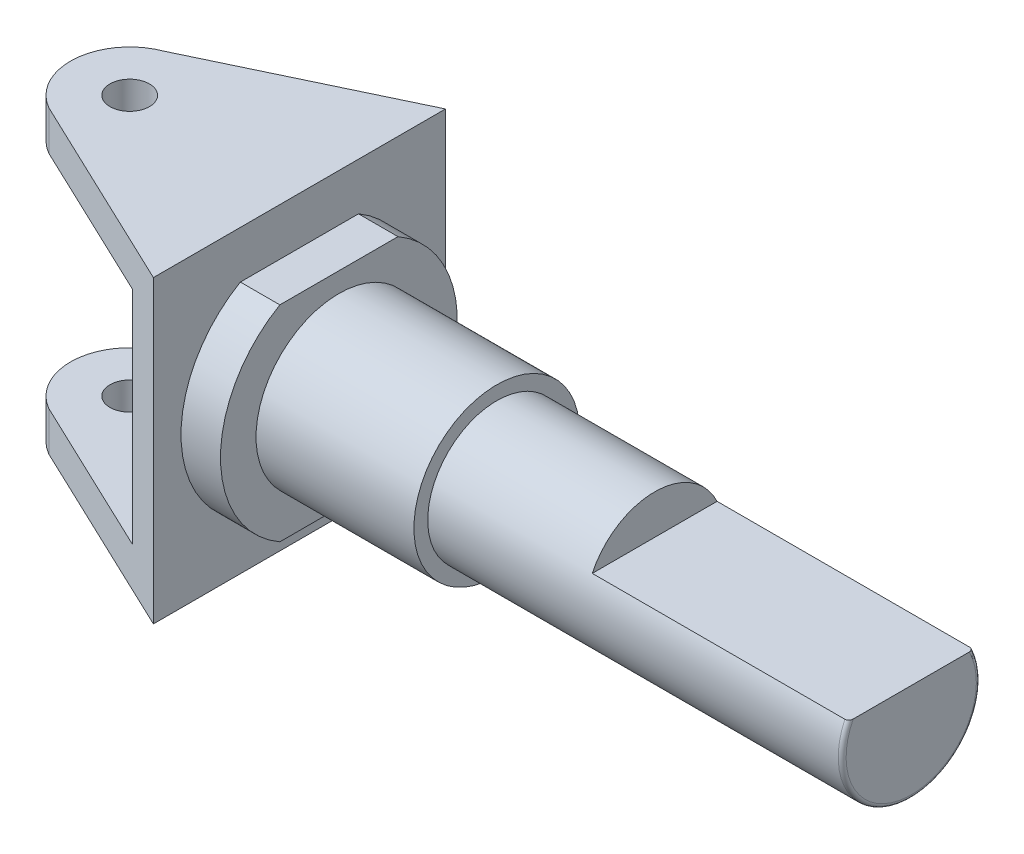
ISO-10303-21;
HEADER;
FILE_DESCRIPTION(('STEP AP214'),'2;1');
FILE_NAME('part.step','',(''),(''),'','','');
FILE_SCHEMA(('AUTOMOTIVE_DESIGN { 1 0 10303 214 1 1 1 1 }'));
ENDSEC;
DATA;
#1=APPLICATION_CONTEXT('core data for automotive mechanical design processes');
#2=APPLICATION_PROTOCOL_DEFINITION('international standard','automotive_design',2000,#1);
#3=PRODUCT_CONTEXT('',#1,'mechanical');
#4=PRODUCT('Part','Part','',(#3));
#5=PRODUCT_RELATED_PRODUCT_CATEGORY('part','',(#4));
#6=PRODUCT_DEFINITION_FORMATION('','',#4);
#7=PRODUCT_DEFINITION_CONTEXT('part definition',#1,'design');
#8=PRODUCT_DEFINITION('design','',#6,#7);
#9=PRODUCT_DEFINITION_SHAPE('','',#8);
#10=(LENGTH_UNIT() NAMED_UNIT(*) SI_UNIT(.MILLI.,.METRE.));
#11=(NAMED_UNIT(*) PLANE_ANGLE_UNIT() SI_UNIT($,.RADIAN.));
#12=(NAMED_UNIT(*) SI_UNIT($,.STERADIAN.) SOLID_ANGLE_UNIT());
#13=UNCERTAINTY_MEASURE_WITH_UNIT(LENGTH_MEASURE(1.E-05),#10,'distance_accuracy_value','');
#14=(GEOMETRIC_REPRESENTATION_CONTEXT(3) GLOBAL_UNCERTAINTY_ASSIGNED_CONTEXT((#13)) GLOBAL_UNIT_ASSIGNED_CONTEXT((#10,
#11,#12)) REPRESENTATION_CONTEXT('',''));
#15=CARTESIAN_POINT('',(0.,0.,0.));
#16=DIRECTION('',(0.,0.,1.));
#17=DIRECTION('',(1.,0.,0.));
#18=AXIS2_PLACEMENT_3D('',#15,#16,#17);
#19=CARTESIAN_POINT('',(-8.94992448054611,-7.89605816136122,37.));
#20=DIRECTION('',(1.,0.,0.));
#21=DIRECTION('',(0.,0.,-1.));
#22=AXIS2_PLACEMENT_3D('',#19,#20,#21);
#23=CYLINDRICAL_SURFACE('',#22,30.);
#24=CARTESIAN_POINT('',(6.05007551945388,-7.89605816136122,37.));
#25=DIRECTION('',(1.,0.,0.));
#26=DIRECTION('',(0.,1.,0.));
#27=AXIS2_PLACEMENT_3D('',#24,#25,#26);
#28=CIRCLE('',#27,30.);
#29=CARTESIAN_POINT('',(6.05007551945388,18.1039418386388,51.9666295470958));
#30=VERTEX_POINT('',#29);
#31=CARTESIAN_POINT('',(6.05007551945389,-33.8960581613612,51.9666295470957));
#32=VERTEX_POINT('',#31);
#33=EDGE_CURVE('E164',#30,#32,#28,.T.);
#34=ORIENTED_EDGE('',*,*,#33,.F.);
#35=DIRECTION('',(1.,0.,0.));
#36=VECTOR('',#35,1.);
#37=CARTESIAN_POINT('',(-3.94992448054611,18.1039418386388,51.9666295470958));
#38=LINE('',#37,#36);
#39=CARTESIAN_POINT('',(-3.94992448054611,18.1039418386388,51.9666295470958));
#40=VERTEX_POINT('',#39);
#41=EDGE_CURVE('E67',#40,#30,#38,.T.);
#42=ORIENTED_EDGE('',*,*,#41,.F.);
#43=CARTESIAN_POINT('',(-3.94992448054611,-7.89605816136122,37.));
#44=DIRECTION('',(-1.,0.,0.));
#45=DIRECTION('',(0.,-1.,0.));
#46=AXIS2_PLACEMENT_3D('',#43,#44,#45);
#47=CIRCLE('',#46,30.);
#48=CARTESIAN_POINT('',(-3.94992448054611,-33.8960581613612,51.9666295470957));
#49=VERTEX_POINT('',#48);
#50=EDGE_CURVE('E162',#49,#40,#47,.T.);
#51=ORIENTED_EDGE('',*,*,#50,.F.);
#52=DIRECTION('',(1.,0.,0.));
#53=VECTOR('',#52,1.);
#54=CARTESIAN_POINT('',(-3.94992448054611,-33.8960581613612,51.9666295470957));
#55=LINE('',#54,#53);
#56=EDGE_CURVE('E520',#49,#32,#55,.T.);
#57=ORIENTED_EDGE('',*,*,#56,.T.);
#58=EDGE_LOOP('',(#34,#42,#51,#57));
#59=FACE_BOUND('',#58,.T.);
#60=ADVANCED_FACE('F39',(#59),#23,.T.);
#61=CARTESIAN_POINT('',(-3.94992448054611,18.1039418386388,22.0333704529042));
#62=VERTEX_POINT('',#61);
#63=CARTESIAN_POINT('',(-3.94992448054611,-33.8960581613612,22.0333704529042));
#64=VERTEX_POINT('',#63);
#65=EDGE_CURVE('E171',#62,#64,#47,.T.);
#66=ORIENTED_EDGE('',*,*,#65,.F.);
#67=DIRECTION('',(1.,0.,0.));
#68=VECTOR('',#67,1.);
#69=CARTESIAN_POINT('',(-3.94992448054611,18.1039418386388,22.0333704529042));
#70=LINE('',#69,#68);
#71=CARTESIAN_POINT('',(6.05007551945389,18.1039418386388,22.0333704529042));
#72=VERTEX_POINT('',#71);
#73=EDGE_CURVE('E151',#62,#72,#70,.T.);
#74=ORIENTED_EDGE('',*,*,#73,.T.);
#75=CARTESIAN_POINT('',(6.05007551945389,-33.8960581613612,22.0333704529042));
#76=VERTEX_POINT('',#75);
#77=EDGE_CURVE('E519',#76,#72,#28,.T.);
#78=ORIENTED_EDGE('',*,*,#77,.F.);
#79=DIRECTION('',(1.,0.,0.));
#80=VECTOR('',#79,1.);
#81=CARTESIAN_POINT('',(-3.94992448054611,-33.8960581613612,22.0333704529042));
#82=LINE('',#81,#80);
#83=EDGE_CURVE('E59',#64,#76,#82,.T.);
#84=ORIENTED_EDGE('',*,*,#83,.F.);
#85=EDGE_LOOP('',(#66,#74,#78,#84));
#86=FACE_BOUND('',#85,.T.);
#87=ADVANCED_FACE('F222',(#86),#23,.T.);
#88=CARTESIAN_POINT('',(6.05007551945389,0.,0.));
#89=DIRECTION('',(1.,0.,0.));
#90=DIRECTION('',(0.,0.,-1.));
#91=AXIS2_PLACEMENT_3D('',#88,#89,#90);
#92=PLANE('',#91);
#93=CARTESIAN_POINT('',(6.05007551945389,-7.89605816136122,37.));
#94=DIRECTION('',(1.,0.,0.));
#95=DIRECTION('',(0.,0.,-1.));
#96=AXIS2_PLACEMENT_3D('',#93,#94,#95);
#97=CIRCLE('',#96,21.);
#98=CARTESIAN_POINT('',(6.05007551945389,-7.89605816136122,16.));
#99=VERTEX_POINT('',#98);
#100=EDGE_CURVE('E179',#99,#99,#97,.T.);
#101=ORIENTED_EDGE('',*,*,#100,.F.);
#102=EDGE_LOOP('',(#101));
#103=FACE_BOUND('',#102,.T.);
#104=ORIENTED_EDGE('',*,*,#77,.T.);
#105=DIRECTION('',(0.,0.,1.));
#106=VECTOR('',#105,1.);
#107=CARTESIAN_POINT('',(6.05007551945389,18.1039418386388,22.0333704529042));
#108=LINE('',#107,#106);
#109=EDGE_CURVE('E156',#72,#30,#108,.T.);
#110=ORIENTED_EDGE('',*,*,#109,.T.);
#111=ORIENTED_EDGE('',*,*,#33,.T.);
#112=DIRECTION('',(0.,0.,-1.));
#113=VECTOR('',#112,1.);
#114=CARTESIAN_POINT('',(6.05007551945389,-33.8960581613612,51.9666295470957));
#115=LINE('',#114,#113);
#116=EDGE_CURVE('E522',#32,#76,#115,.T.);
#117=ORIENTED_EDGE('',*,*,#116,.T.);
#118=EDGE_LOOP('',(#104,#110,#111,#117));
#119=FACE_BOUND('',#118,.T.);
#120=ADVANCED_FACE('F223',(#103,#119),#92,.T.);
#121=CARTESIAN_POINT('',(-61.9499244805461,30.1039418386388,74.));
#122=DIRECTION('',(0.,-1.,0.));
#123=DIRECTION('',(0.,0.,-1.));
#124=AXIS2_PLACEMENT_3D('',#121,#122,#123);
#125=PLANE('',#124);
#126=CARTESIAN_POINT('',(-46.9499244805461,30.1039418386388,37.));
#127=DIRECTION('',(0.,1.,0.));
#128=DIRECTION('',(0.,0.,1.));
#129=AXIS2_PLACEMENT_3D('',#126,#127,#128);
#130=CIRCLE('',#129,5.);
#131=CARTESIAN_POINT('',(-46.9499244805461,30.1039418386388,42.));
#132=VERTEX_POINT('',#131);
#133=EDGE_CURVE('E170',#132,#132,#130,.T.);
#134=ORIENTED_EDGE('',*,*,#133,.F.);
#135=EDGE_LOOP('',(#134));
#136=FACE_BOUND('',#135,.T.);
#137=CARTESIAN_POINT('',(-46.9499244805461,30.1039418386388,37.));
#138=DIRECTION('',(0.,1.,0.));
#139=DIRECTION('',(0.,0.,1.));
#140=AXIS2_PLACEMENT_3D('',#137,#138,#139);
#141=CIRCLE('',#140,15.);
#142=CARTESIAN_POINT('',(-52.267361900777,30.1039418386388,22.9741360593392));
#143=VERTEX_POINT('',#142);
#144=CARTESIAN_POINT('',(-54.4721482602545,30.1039418386388,49.9775247797101));
#145=VERTEX_POINT('',#144);
#146=EDGE_CURVE('E271',#143,#145,#141,.T.);
#147=ORIENTED_EDGE('',*,*,#146,.T.);
#148=DIRECTION('',(-0.903108265488569,0.,-0.429412925755885));
#149=VECTOR('',#148,1.);
#150=CARTESIAN_POINT('',(-29.426018974015,30.1039418386388,61.8865417455175));
#151=LINE('',#150,#149);
#152=CARTESIAN_POINT('',(-3.94992448054612,30.1039418386388,74.));
#153=VERTEX_POINT('',#152);
#154=EDGE_CURVE('E275',#153,#145,#151,.T.);
#155=ORIENTED_EDGE('',*,*,#154,.F.);
#156=DIRECTION('',(0.,0.,-1.));
#157=VECTOR('',#156,1.);
#158=CARTESIAN_POINT('',(-3.94992448054612,30.1039418386388,74.));
#159=LINE('',#158,#157);
#160=CARTESIAN_POINT('',(-3.94992448054612,30.1039418386388,0.));
#161=VERTEX_POINT('',#160);
#162=EDGE_CURVE('E326',#153,#161,#159,.T.);
#163=ORIENTED_EDGE('',*,*,#162,.T.);
#164=DIRECTION('',(-0.903108265488569,0.,0.429412925755885));
#165=VECTOR('',#164,1.);
#166=CARTESIAN_POINT('',(-0.728348144740107,30.1039418386388,-1.53180584517847));
#167=LINE('',#166,#165);
#168=EDGE_CURVE('E277',#161,#143,#167,.T.);
#169=ORIENTED_EDGE('',*,*,#168,.T.);
#170=EDGE_LOOP('',(#147,#155,#163,#169));
#171=FACE_BOUND('',#170,.T.);
#172=ADVANCED_FACE('F226',(#136,#171),#125,.F.);
#173=CARTESIAN_POINT('',(-61.9499244805461,20.1039418386388,74.));
#174=DIRECTION('',(0.,1.,0.));
#175=DIRECTION('',(0.,0.,1.));
#176=AXIS2_PLACEMENT_3D('',#173,#174,#175);
#177=PLANE('',#176);
#178=CARTESIAN_POINT('',(-46.9499244805461,20.1039418386388,37.));
#179=DIRECTION('',(0.,1.,0.));
#180=DIRECTION('',(0.,0.,1.));
#181=AXIS2_PLACEMENT_3D('',#178,#179,#180);
#182=CIRCLE('',#181,5.);
#183=CARTESIAN_POINT('',(-46.9499244805461,20.1039418386388,42.));
#184=VERTEX_POINT('',#183);
#185=EDGE_CURVE('E290',#184,#184,#182,.T.);
#186=ORIENTED_EDGE('',*,*,#185,.T.);
#187=EDGE_LOOP('',(#186));
#188=FACE_BOUND('',#187,.T.);
#189=DIRECTION('',(-0.903108265488569,0.,-0.429412925755885));
#190=VECTOR('',#189,1.);
#191=CARTESIAN_POINT('',(-51.2549877537848,20.1039418386388,51.5072309716494));
#192=LINE('',#191,#190);
#193=CARTESIAN_POINT('',(-13.9499244805461,20.1039418386388,69.2451666963365));
#194=VERTEX_POINT('',#193);
#195=CARTESIAN_POINT('',(-54.4721482602545,20.1039418386388,49.9775247797101));
#196=VERTEX_POINT('',#195);
#197=EDGE_CURVE('E279',#194,#196,#192,.T.);
#198=ORIENTED_EDGE('',*,*,#197,.T.);
#199=CARTESIAN_POINT('',(-46.9499244805461,20.1039418386388,37.));
#200=DIRECTION('',(0.,1.,0.));
#201=DIRECTION('',(0.,0.,1.));
#202=AXIS2_PLACEMENT_3D('',#199,#200,#201);
#203=CIRCLE('',#202,15.);
#204=CARTESIAN_POINT('',(-52.267361900777,20.1039418386388,22.9741360593392));
#205=VERTEX_POINT('',#204);
#206=EDGE_CURVE('E284',#205,#196,#203,.T.);
#207=ORIENTED_EDGE('',*,*,#206,.F.);
#208=DIRECTION('',(-0.903108265488569,0.,0.429412925755885));
#209=VECTOR('',#208,1.);
#210=CARTESIAN_POINT('',(-79.9526585830597,20.1039418386388,36.1380331280115));
#211=LINE('',#210,#209);
#212=CARTESIAN_POINT('',(-13.9499244805461,20.1039418386388,4.75483330366351));
#213=VERTEX_POINT('',#212);
#214=EDGE_CURVE('E319',#213,#205,#211,.T.);
#215=ORIENTED_EDGE('',*,*,#214,.F.);
#216=DIRECTION('',(0.,0.,-1.));
#217=VECTOR('',#216,1.);
#218=CARTESIAN_POINT('',(-13.9499244805461,20.1039418386388,74.));
#219=LINE('',#218,#217);
#220=EDGE_CURVE('E335',#194,#213,#219,.T.);
#221=ORIENTED_EDGE('',*,*,#220,.F.);
#222=EDGE_LOOP('',(#198,#207,#215,#221));
#223=FACE_BOUND('',#222,.T.);
#224=ADVANCED_FACE('F255',(#188,#223),#177,.F.);
#225=CARTESIAN_POINT('',(-61.9499244805461,-35.8960581613612,74.));
#226=DIRECTION('',(0.,-1.,0.));
#227=DIRECTION('',(0.,0.,-1.));
#228=AXIS2_PLACEMENT_3D('',#225,#226,#227);
#229=PLANE('',#228);
#230=CARTESIAN_POINT('',(-46.9499244805461,-35.8960581613612,37.));
#231=DIRECTION('',(0.,-1.,0.));
#232=DIRECTION('',(0.,0.,-1.));
#233=AXIS2_PLACEMENT_3D('',#230,#231,#232);
#234=CIRCLE('',#233,5.);
#235=CARTESIAN_POINT('',(-46.9499244805461,-35.8960581613612,32.));
#236=VERTEX_POINT('',#235);
#237=EDGE_CURVE('E293',#236,#236,#234,.T.);
#238=ORIENTED_EDGE('',*,*,#237,.T.);
#239=EDGE_LOOP('',(#238));
#240=FACE_BOUND('',#239,.T.);
#241=CARTESIAN_POINT('',(-46.9499244805461,-35.8960581613612,37.));
#242=DIRECTION('',(0.,-1.,0.));
#243=DIRECTION('',(0.,0.,-1.));
#244=AXIS2_PLACEMENT_3D('',#241,#242,#243);
#245=CIRCLE('',#244,15.);
#246=CARTESIAN_POINT('',(-54.4721482602545,-35.8960581613612,49.9775247797101));
#247=VERTEX_POINT('',#246);
#248=CARTESIAN_POINT('',(-52.267361900777,-35.8960581613612,22.9741360593392));
#249=VERTEX_POINT('',#248);
#250=EDGE_CURVE('E321',#247,#249,#245,.T.);
#251=ORIENTED_EDGE('',*,*,#250,.F.);
#252=DIRECTION('',(0.903108265488569,0.,0.429412925755885));
#253=VECTOR('',#252,1.);
#254=CARTESIAN_POINT('',(-51.2549877537848,-35.8960581613612,51.5072309716494));
#255=LINE('',#254,#253);
#256=CARTESIAN_POINT('',(-13.9499244805461,-35.8960581613612,69.2451666963365));
#257=VERTEX_POINT('',#256);
#258=EDGE_CURVE('E300',#247,#257,#255,.T.);
#259=ORIENTED_EDGE('',*,*,#258,.T.);
#260=DIRECTION('',(0.,0.,-1.));
#261=VECTOR('',#260,1.);
#262=CARTESIAN_POINT('',(-13.9499244805461,-35.8960581613612,74.));
#263=LINE('',#262,#261);
#264=CARTESIAN_POINT('',(-13.9499244805461,-35.8960581613612,4.75483330366351));
#265=VERTEX_POINT('',#264);
#266=EDGE_CURVE('E333',#257,#265,#263,.T.);
#267=ORIENTED_EDGE('',*,*,#266,.T.);
#268=DIRECTION('',(0.903108265488569,0.,-0.429412925755885));
#269=VECTOR('',#268,1.);
#270=CARTESIAN_POINT('',(-79.9526585830597,-35.8960581613612,36.1380331280115));
#271=LINE('',#270,#269);
#272=EDGE_CURVE('E313',#249,#265,#271,.T.);
#273=ORIENTED_EDGE('',*,*,#272,.F.);
#274=EDGE_LOOP('',(#251,#259,#267,#273));
#275=FACE_BOUND('',#274,.T.);
#276=ADVANCED_FACE('F251',(#240,#275),#229,.F.);
#277=CARTESIAN_POINT('',(-3.94992448054611,-45.8960581613612,74.));
#278=DIRECTION('',(0.,1.,0.));
#279=DIRECTION('',(-1.,0.,0.));
#280=AXIS2_PLACEMENT_3D('',#277,#278,#279);
#281=PLANE('',#280);
#282=CARTESIAN_POINT('',(-46.9499244805461,-45.8960581613612,37.));
#283=DIRECTION('',(0.,1.,0.));
#284=DIRECTION('',(-1.,0.,0.));
#285=AXIS2_PLACEMENT_3D('',#282,#283,#284);
#286=CIRCLE('',#285,5.);
#287=CARTESIAN_POINT('',(-51.9499244805461,-45.8960581613612,37.));
#288=VERTEX_POINT('',#287);
#289=EDGE_CURVE('E174',#288,#288,#286,.T.);
#290=ORIENTED_EDGE('',*,*,#289,.T.);
#291=EDGE_LOOP('',(#290));
#292=FACE_BOUND('',#291,.T.);
#293=DIRECTION('',(-0.903108265488569,0.,-0.429412925755885));
#294=VECTOR('',#293,1.);
#295=CARTESIAN_POINT('',(-3.94992448054611,-45.8960581613612,74.));
#296=LINE('',#295,#294);
#297=CARTESIAN_POINT('',(-3.94992448054612,-45.8960581613612,74.));
#298=VERTEX_POINT('',#297);
#299=CARTESIAN_POINT('',(-54.4721482602545,-45.8960581613612,49.9775247797101));
#300=VERTEX_POINT('',#299);
#301=EDGE_CURVE('E297',#298,#300,#296,.T.);
#302=ORIENTED_EDGE('',*,*,#301,.T.);
#303=CARTESIAN_POINT('',(-46.9499244805461,-45.8960581613612,37.));
#304=DIRECTION('',(0.,1.,0.));
#305=DIRECTION('',(-1.,0.,0.));
#306=AXIS2_PLACEMENT_3D('',#303,#304,#305);
#307=CIRCLE('',#306,15.);
#308=CARTESIAN_POINT('',(-52.267361900777,-45.8960581613612,22.9741360593392));
#309=VERTEX_POINT('',#308);
#310=EDGE_CURVE('E183',#309,#300,#307,.T.);
#311=ORIENTED_EDGE('',*,*,#310,.F.);
#312=DIRECTION('',(-0.903108265488569,0.,0.429412925755885));
#313=VECTOR('',#312,1.);
#314=CARTESIAN_POINT('',(-32.647595309821,-45.8960581613612,13.645264099661));
#315=LINE('',#314,#313);
#316=CARTESIAN_POINT('',(-3.94992448054612,-45.8960581613612,0.));
#317=VERTEX_POINT('',#316);
#318=EDGE_CURVE('E311',#317,#309,#315,.T.);
#319=ORIENTED_EDGE('',*,*,#318,.F.);
#320=DIRECTION('',(0.,0.,-1.));
#321=VECTOR('',#320,1.);
#322=CARTESIAN_POINT('',(-3.94992448054611,-45.8960581613612,74.));
#323=LINE('',#322,#321);
#324=EDGE_CURVE('E330',#298,#317,#323,.T.);
#325=ORIENTED_EDGE('',*,*,#324,.F.);
#326=EDGE_LOOP('',(#302,#311,#319,#325));
#327=FACE_BOUND('',#326,.T.);
#328=ADVANCED_FACE('F248',(#292,#327),#281,.F.);
#329=CARTESIAN_POINT('',(-13.9499244805461,-35.8960581613612,74.));
#330=DIRECTION('',(1.,0.,0.));
#331=DIRECTION('',(0.,0.,-1.));
#332=AXIS2_PLACEMENT_3D('',#329,#330,#331);
#333=PLANE('',#332);
#334=ORIENTED_EDGE('',*,*,#266,.F.);
#335=DIRECTION('',(0.,1.,0.));
#336=VECTOR('',#335,1.);
#337=CARTESIAN_POINT('',(-13.9499244805461,-35.8960581613612,69.2451666963365));
#338=LINE('',#337,#336);
#339=EDGE_CURVE('E303',#257,#194,#338,.T.);
#340=ORIENTED_EDGE('',*,*,#339,.T.);
#341=ORIENTED_EDGE('',*,*,#220,.T.);
#342=DIRECTION('',(0.,1.,0.));
#343=VECTOR('',#342,1.);
#344=CARTESIAN_POINT('',(-13.9499244805461,-35.8960581613612,4.75483330366351));
#345=LINE('',#344,#343);
#346=EDGE_CURVE('E316',#265,#213,#345,.T.);
#347=ORIENTED_EDGE('',*,*,#346,.F.);
#348=EDGE_LOOP('',(#334,#340,#341,#347));
#349=FACE_BOUND('',#348,.T.);
#350=ADVANCED_FACE('F247',(#349),#333,.F.);
#351=CARTESIAN_POINT('',(-3.94992448054612,30.1039418386388,74.));
#352=DIRECTION('',(-1.,0.,0.));
#353=DIRECTION('',(0.,-1.,0.));
#354=AXIS2_PLACEMENT_3D('',#351,#352,#353);
#355=PLANE('',#354);
#356=ORIENTED_EDGE('',*,*,#50,.T.);
#357=DIRECTION('',(0.,0.,1.));
#358=VECTOR('',#357,1.);
#359=CARTESIAN_POINT('',(-3.94992448054611,18.1039418386388,22.0333704529042));
#360=LINE('',#359,#358);
#361=EDGE_CURVE('E148',#62,#40,#360,.T.);
#362=ORIENTED_EDGE('',*,*,#361,.F.);
#363=ORIENTED_EDGE('',*,*,#65,.T.);
#364=DIRECTION('',(0.,0.,-1.));
#365=VECTOR('',#364,1.);
#366=CARTESIAN_POINT('',(-3.94992448054611,-33.8960581613612,51.9666295470957));
#367=LINE('',#366,#365);
#368=EDGE_CURVE('E169',#49,#64,#367,.T.);
#369=ORIENTED_EDGE('',*,*,#368,.F.);
#370=EDGE_LOOP('',(#356,#362,#363,#369));
#371=FACE_BOUND('',#370,.T.);
#372=DIRECTION('',(0.,1.,0.));
#373=VECTOR('',#372,1.);
#374=CARTESIAN_POINT('',(-3.94992448054612,30.1039418386388,0.));
#375=LINE('',#374,#373);
#376=EDGE_CURVE('E324',#317,#161,#375,.T.);
#377=ORIENTED_EDGE('',*,*,#376,.T.);
#378=ORIENTED_EDGE('',*,*,#162,.F.);
#379=DIRECTION('',(0.,1.,0.));
#380=VECTOR('',#379,1.);
#381=CARTESIAN_POINT('',(-3.94992448054612,30.1039418386388,74.));
#382=LINE('',#381,#380);
#383=EDGE_CURVE('E289',#298,#153,#382,.T.);
#384=ORIENTED_EDGE('',*,*,#383,.F.);
#385=ORIENTED_EDGE('',*,*,#324,.T.);
#386=EDGE_LOOP('',(#377,#378,#384,#385));
#387=FACE_BOUND('',#386,.T.);
#388=ADVANCED_FACE('F167',(#371,#387),#355,.F.);
#389=CARTESIAN_POINT('',(-46.9499244805461,-69.8960581613612,37.));
#390=DIRECTION('',(0.,1.,0.));
#391=DIRECTION('',(0.,0.,1.));
#392=AXIS2_PLACEMENT_3D('',#389,#390,#391);
#393=CYLINDRICAL_SURFACE('',#392,15.);
#394=ORIENTED_EDGE('',*,*,#206,.T.);
#395=DIRECTION('',(0.,1.,0.));
#396=VECTOR('',#395,1.);
#397=CARTESIAN_POINT('',(-54.4721482602545,-69.8960581613612,49.9775247797101));
#398=LINE('',#397,#396);
#399=EDGE_CURVE('E282',#196,#145,#398,.T.);
#400=ORIENTED_EDGE('',*,*,#399,.T.);
#401=ORIENTED_EDGE('',*,*,#146,.F.);
#402=DIRECTION('',(0.,1.,0.));
#403=VECTOR('',#402,1.);
#404=CARTESIAN_POINT('',(-52.267361900777,-69.8960581613612,22.9741360593392));
#405=LINE('',#404,#403);
#406=EDGE_CURVE('E308',#205,#143,#405,.T.);
#407=ORIENTED_EDGE('',*,*,#406,.F.);
#408=EDGE_LOOP('',(#394,#400,#401,#407));
#409=FACE_BOUND('',#408,.T.);
#410=ADVANCED_FACE('F241',(#409),#393,.T.);
#411=ORIENTED_EDGE('',*,*,#250,.T.);
#412=EDGE_CURVE('E310',#309,#249,#405,.T.);
#413=ORIENTED_EDGE('',*,*,#412,.F.);
#414=ORIENTED_EDGE('',*,*,#310,.T.);
#415=EDGE_CURVE('E286',#300,#247,#398,.T.);
#416=ORIENTED_EDGE('',*,*,#415,.T.);
#417=EDGE_LOOP('',(#411,#413,#414,#416));
#418=FACE_BOUND('',#417,.T.);
#419=ADVANCED_FACE('F239',(#418),#393,.T.);
#420=CARTESIAN_POINT('',(-0.728348144740107,-69.8960581613612,-1.53180584517847));
#421=DIRECTION('',(-0.429412925755885,0.,-0.903108265488569));
#422=DIRECTION('',(-0.903108265488569,0.,0.429412925755885));
#423=AXIS2_PLACEMENT_3D('',#420,#421,#422);
#424=PLANE('',#423);
#425=ORIENTED_EDGE('',*,*,#214,.T.);
#426=ORIENTED_EDGE('',*,*,#406,.T.);
#427=ORIENTED_EDGE('',*,*,#168,.F.);
#428=ORIENTED_EDGE('',*,*,#376,.F.);
#429=ORIENTED_EDGE('',*,*,#318,.T.);
#430=ORIENTED_EDGE('',*,*,#412,.T.);
#431=ORIENTED_EDGE('',*,*,#272,.T.);
#432=ORIENTED_EDGE('',*,*,#346,.T.);
#433=EDGE_LOOP('',(#425,#426,#427,#428,#429,#430,#431,#432));
#434=FACE_BOUND('',#433,.T.);
#435=ADVANCED_FACE('F235',(#434),#424,.T.);
#436=CARTESIAN_POINT('',(-29.426018974015,-69.8960581613612,61.8865417455175));
#437=DIRECTION('',(0.429412925755885,0.,-0.903108265488569));
#438=DIRECTION('',(-0.903108265488569,0.,-0.429412925755885));
#439=AXIS2_PLACEMENT_3D('',#436,#437,#438);
#440=PLANE('',#439);
#441=ORIENTED_EDGE('',*,*,#339,.F.);
#442=ORIENTED_EDGE('',*,*,#258,.F.);
#443=ORIENTED_EDGE('',*,*,#415,.F.);
#444=ORIENTED_EDGE('',*,*,#301,.F.);
#445=ORIENTED_EDGE('',*,*,#383,.T.);
#446=ORIENTED_EDGE('',*,*,#154,.T.);
#447=ORIENTED_EDGE('',*,*,#399,.F.);
#448=ORIENTED_EDGE('',*,*,#197,.F.);
#449=EDGE_LOOP('',(#441,#442,#443,#444,#445,#446,#447,#448));
#450=FACE_BOUND('',#449,.T.);
#451=ADVANCED_FACE('F232',(#450),#440,.F.);
#452=CARTESIAN_POINT('',(-46.9499244805461,-69.8960581613612,37.));
#453=DIRECTION('',(0.,1.,0.));
#454=DIRECTION('',(0.,0.,1.));
#455=AXIS2_PLACEMENT_3D('',#452,#453,#454);
#456=CYLINDRICAL_SURFACE('',#455,5.);
#457=ORIENTED_EDGE('',*,*,#289,.F.);
#458=EDGE_LOOP('',(#457));
#459=FACE_BOUND('',#458,.T.);
#460=ORIENTED_EDGE('',*,*,#237,.F.);
#461=EDGE_LOOP('',(#460));
#462=FACE_BOUND('',#461,.T.);
#463=ADVANCED_FACE('F230',(#459,#462),#456,.F.);
#464=ORIENTED_EDGE('',*,*,#133,.T.);
#465=EDGE_LOOP('',(#464));
#466=FACE_BOUND('',#465,.T.);
#467=ORIENTED_EDGE('',*,*,#185,.F.);
#468=EDGE_LOOP('',(#467));
#469=FACE_BOUND('',#468,.T.);
#470=ADVANCED_FACE('F216',(#466,#469),#456,.F.);
#471=CARTESIAN_POINT('',(46.0500755194539,0.,0.));
#472=DIRECTION('',(1.,0.,0.));
#473=DIRECTION('',(0.,0.,-1.));
#474=AXIS2_PLACEMENT_3D('',#471,#472,#473);
#475=PLANE('',#474);
#476=CARTESIAN_POINT('',(46.0500755194539,-7.89605816136123,37.));
#477=DIRECTION('',(1.,0.,0.));
#478=DIRECTION('',(0.,0.,-1.));
#479=AXIS2_PLACEMENT_3D('',#476,#477,#478);
#480=CIRCLE('',#479,17.5);
#481=CARTESIAN_POINT('',(46.0500755194539,-7.89605816136123,19.5));
#482=VERTEX_POINT('',#481);
#483=EDGE_CURVE('E182',#482,#482,#480,.T.);
#484=ORIENTED_EDGE('',*,*,#483,.F.);
#485=EDGE_LOOP('',(#484));
#486=FACE_BOUND('',#485,.T.);
#487=CARTESIAN_POINT('',(46.0500755194539,-7.89605816136122,37.));
#488=DIRECTION('',(1.,0.,0.));
#489=DIRECTION('',(0.,0.,-1.));
#490=AXIS2_PLACEMENT_3D('',#487,#488,#489);
#491=CIRCLE('',#490,21.);
#492=CARTESIAN_POINT('',(46.0500755194539,-7.89605816136122,16.));
#493=VERTEX_POINT('',#492);
#494=EDGE_CURVE('E539',#493,#493,#491,.T.);
#495=ORIENTED_EDGE('',*,*,#494,.T.);
#496=EDGE_LOOP('',(#495));
#497=FACE_BOUND('',#496,.T.);
#498=ADVANCED_FACE('F208',(#486,#497),#475,.T.);
#499=CARTESIAN_POINT('',(1.05007551945389,-7.89605816136122,37.));
#500=DIRECTION('',(1.,0.,0.));
#501=DIRECTION('',(0.,0.,-1.));
#502=AXIS2_PLACEMENT_3D('',#499,#500,#501);
#503=CYLINDRICAL_SURFACE('',#502,21.);
#504=CARTESIAN_POINT('',(6.05007551945389,-7.89605816136122,16.));
#505=CARTESIAN_POINT('',(6.46674218612056,-7.89605816136122,16.));
#506=CARTESIAN_POINT('',(6.88340885278722,-7.89605816136122,16.));
#507=CARTESIAN_POINT('',(7.71674218612056,-7.89605816136122,16.));
#508=CARTESIAN_POINT('',(8.13340885278722,-7.89605816136122,16.));
#509=CARTESIAN_POINT('',(8.96674218612056,-7.89605816136122,16.));
#510=CARTESIAN_POINT('',(9.38340885278722,-7.89605816136122,16.));
#511=CARTESIAN_POINT('',(10.2167421861206,-7.89605816136122,16.));
#512=CARTESIAN_POINT('',(10.6334088527872,-7.89605816136122,16.));
#513=CARTESIAN_POINT('',(11.4667421861206,-7.89605816136122,16.));
#514=CARTESIAN_POINT('',(11.8834088527872,-7.89605816136122,16.));
#515=CARTESIAN_POINT('',(12.7167421861206,-7.89605816136122,16.));
#516=CARTESIAN_POINT('',(13.1334088527872,-7.89605816136122,16.));
#517=CARTESIAN_POINT('',(13.9667421861206,-7.89605816136122,16.));
#518=CARTESIAN_POINT('',(14.3834088527872,-7.89605816136122,16.));
#519=CARTESIAN_POINT('',(15.2167421861206,-7.89605816136122,16.));
#520=CARTESIAN_POINT('',(15.6334088527872,-7.89605816136122,16.));
#521=CARTESIAN_POINT('',(16.4667421861206,-7.89605816136122,16.));
#522=CARTESIAN_POINT('',(16.8834088527872,-7.89605816136122,16.));
#523=CARTESIAN_POINT('',(17.7167421861206,-7.89605816136122,16.));
#524=CARTESIAN_POINT('',(18.1334088527872,-7.89605816136122,16.));
#525=CARTESIAN_POINT('',(18.9667421861206,-7.89605816136122,16.));
#526=CARTESIAN_POINT('',(19.3834088527872,-7.89605816136122,16.));
#527=CARTESIAN_POINT('',(20.2167421861206,-7.89605816136122,16.));
#528=CARTESIAN_POINT('',(20.6334088527872,-7.89605816136122,16.));
#529=CARTESIAN_POINT('',(21.4667421861205,-7.89605816136122,16.));
#530=CARTESIAN_POINT('',(21.8834088527872,-7.89605816136122,16.));
#531=CARTESIAN_POINT('',(22.7167421861206,-7.89605816136122,16.));
#532=CARTESIAN_POINT('',(23.1334088527872,-7.89605816136122,16.));
#533=CARTESIAN_POINT('',(23.9667421861206,-7.89605816136122,16.));
#534=CARTESIAN_POINT('',(24.3834088527872,-7.89605816136122,16.));
#535=CARTESIAN_POINT('',(25.2167421861205,-7.89605816136122,16.));
#536=CARTESIAN_POINT('',(25.6334088527872,-7.89605816136122,16.));
#537=CARTESIAN_POINT('',(26.4667421861206,-7.89605816136122,16.));
#538=CARTESIAN_POINT('',(26.8834088527872,-7.89605816136122,16.));
#539=CARTESIAN_POINT('',(27.7167421861206,-7.89605816136122,16.));
#540=CARTESIAN_POINT('',(28.1334088527872,-7.89605816136122,16.));
#541=CARTESIAN_POINT('',(28.9667421861205,-7.89605816136122,16.));
#542=CARTESIAN_POINT('',(29.3834088527872,-7.89605816136122,16.));
#543=CARTESIAN_POINT('',(30.2167421861206,-7.89605816136122,16.));
#544=CARTESIAN_POINT('',(30.6334088527872,-7.89605816136122,16.));
#545=CARTESIAN_POINT('',(31.4667421861205,-7.89605816136122,16.));
#546=CARTESIAN_POINT('',(31.8834088527872,-7.89605816136122,16.));
#547=CARTESIAN_POINT('',(32.7167421861205,-7.89605816136122,16.));
#548=CARTESIAN_POINT('',(33.1334088527872,-7.89605816136122,16.));
#549=CARTESIAN_POINT('',(33.9667421861205,-7.89605816136122,16.));
#550=CARTESIAN_POINT('',(34.3834088527872,-7.89605816136122,16.));
#551=CARTESIAN_POINT('',(35.2167421861205,-7.89605816136122,16.));
#552=CARTESIAN_POINT('',(35.6334088527872,-7.89605816136122,16.));
#553=CARTESIAN_POINT('',(36.4667421861206,-7.89605816136122,16.));
#554=CARTESIAN_POINT('',(36.8834088527872,-7.89605816136122,16.));
#555=CARTESIAN_POINT('',(37.7167421861205,-7.89605816136122,16.));
#556=CARTESIAN_POINT('',(38.1334088527872,-7.89605816136122,16.));
#557=CARTESIAN_POINT('',(38.9667421861205,-7.89605816136122,16.));
#558=CARTESIAN_POINT('',(39.3834088527872,-7.89605816136122,16.));
#559=CARTESIAN_POINT('',(40.2167421861205,-7.89605816136122,16.));
#560=CARTESIAN_POINT('',(40.6334088527872,-7.89605816136122,16.));
#561=CARTESIAN_POINT('',(41.4667421861205,-7.89605816136122,16.));
#562=CARTESIAN_POINT('',(41.8834088527872,-7.89605816136122,16.));
#563=CARTESIAN_POINT('',(42.7167421861205,-7.89605816136122,16.));
#564=CARTESIAN_POINT('',(43.1334088527872,-7.89605816136122,16.));
#565=CARTESIAN_POINT('',(43.9667421861205,-7.89605816136122,16.));
#566=CARTESIAN_POINT('',(44.3834088527872,-7.89605816136122,16.));
#567=CARTESIAN_POINT('',(45.2167421861205,-7.89605816136122,16.));
#568=CARTESIAN_POINT('',(45.6334088527872,-7.89605816136122,16.));
#569=CARTESIAN_POINT('',(46.0500755194539,-7.89605816136122,16.));
#570=B_SPLINE_CURVE_WITH_KNOTS('',3,(#504,#505,#506,#507,#508,#509,#510,#511,#512,#513,#514,
#515,#516,#517,#518,#519,#520,#521,#522,#523,#524,#525,#526,#527,#528,#529,#530,#531,#532,#533,
#534,#535,#536,#537,#538,#539,#540,#541,#542,#543,#544,#545,#546,#547,#548,#549,#550,#551,#552,
#553,#554,#555,#556,#557,#558,#559,#560,#561,#562,#563,#564,#565,#566,#567,#568,#569),
.UNSPECIFIED.,.F.,.F.,(4,2,2,2,2,2,2,2,2,2,2,2,2,2,2,2,2,2,2,2,2,2,2,2,2,2,2,2,2,2,2,2,4),(0.,
1.25,2.5,3.75,5.,6.25,7.5,8.75,9.99999999999999,11.25,12.5,13.75,15.,16.25,17.5,18.75,20.,21.25,
22.5,23.75,25.,26.25,27.5,28.75,30.,31.25,32.5,33.75,35.,36.25,37.5,38.75,40.),.UNSPECIFIED.);
#571=EDGE_CURVE('BSEAM211',#99,#493,#570,.T.);
#572=ORIENTED_EDGE('',*,*,#100,.T.);
#573=ORIENTED_EDGE('',*,*,#494,.F.);
#574=ORIENTED_EDGE('',*,*,#571,.T.);
#575=ORIENTED_EDGE('',*,*,#571,.F.);
#576=EDGE_LOOP('',(#572,#574,#573,#575));
#577=FACE_BOUND('',#576,.T.);
#578=ADVANCED_FACE('F211',(#577),#503,.T.);
#579=CARTESIAN_POINT('',(151.050075519454,0.,0.));
#580=DIRECTION('',(1.,0.,0.));
#581=DIRECTION('',(0.,0.,-1.));
#582=AXIS2_PLACEMENT_3D('',#579,#580,#581);
#583=PLANE('',#582);
#584=DIRECTION('',(0.,0.,-1.));
#585=VECTOR('',#584,1.);
#586=CARTESIAN_POINT('',(151.050075519454,-0.396058161361224,52.8113883008419));
#587=LINE('',#586,#585);
#588=CARTESIAN_POINT('',(151.050075519454,-0.396058161361224,51.6969384566991));
#589=VERTEX_POINT('',#588);
#590=CARTESIAN_POINT('',(151.050075519454,-0.396058161361224,22.3030615433009));
#591=VERTEX_POINT('',#590);
#592=EDGE_CURVE('E531',#589,#591,#587,.T.);
#593=ORIENTED_EDGE('',*,*,#592,.F.);
#594=CARTESIAN_POINT('',(151.050075519454,-7.89605816136123,37.));
#595=DIRECTION('',(1.,0.,0.));
#596=DIRECTION('',(0.,0.,-1.));
#597=AXIS2_PLACEMENT_3D('',#594,#595,#596);
#598=CIRCLE('',#597,16.5);
#599=EDGE_CURVE('E186',#589,#591,#598,.T.);
#600=ORIENTED_EDGE('',*,*,#599,.T.);
#601=EDGE_LOOP('',(#593,#600));
#602=FACE_BOUND('',#601,.T.);
#603=ADVANCED_FACE('F206',(#602),#583,.T.);
#604=CARTESIAN_POINT('',(41.0500755194539,-7.89605816136123,37.));
#605=DIRECTION('',(1.,0.,0.));
#606=DIRECTION('',(0.,0.,-1.));
#607=AXIS2_PLACEMENT_3D('',#604,#605,#606);
#608=CYLINDRICAL_SURFACE('',#607,17.5);
#609=DIRECTION('',(1.,0.,0.));
#610=VECTOR('',#609,1.);
#611=CARTESIAN_POINT('',(86.0500755194539,-0.396058161361224,21.1886116991581));
#612=LINE('',#611,#610);
#613=CARTESIAN_POINT('',(86.0500755194539,-0.396058161361224,21.1886116991581));
#614=VERTEX_POINT('',#613);
#615=CARTESIAN_POINT('',(150.050075519454,-0.396058161361224,21.1886116991581));
#616=VERTEX_POINT('',#615);
#617=EDGE_CURVE('E536',#614,#616,#612,.T.);
#618=ORIENTED_EDGE('',*,*,#617,.T.);
#619=CARTESIAN_POINT('',(150.050075519454,-7.89605816136123,37.));
#620=DIRECTION('',(1.,0.,0.));
#621=DIRECTION('',(0.,0.,-1.));
#622=AXIS2_PLACEMENT_3D('',#619,#620,#621);
#623=CIRCLE('',#622,17.5);
#624=CARTESIAN_POINT('',(150.050075519454,-0.396058161361224,52.8113883008419));
#625=VERTEX_POINT('',#624);
#626=EDGE_CURVE('E189',#616,#625,#623,.F.);
#627=ORIENTED_EDGE('',*,*,#626,.T.);
#628=DIRECTION('',(1.,0.,0.));
#629=VECTOR('',#628,1.);
#630=CARTESIAN_POINT('',(86.0500755194539,-0.396058161361224,52.8113883008419));
#631=LINE('',#630,#629);
#632=CARTESIAN_POINT('',(86.0500755194539,-0.396058161361224,52.8113883008419));
#633=VERTEX_POINT('',#632);
#634=EDGE_CURVE('E534',#633,#625,#631,.T.);
#635=ORIENTED_EDGE('',*,*,#634,.F.);
#636=CARTESIAN_POINT('',(86.0500755194539,-7.89605816136122,37.));
#637=DIRECTION('',(1.,0.,0.));
#638=DIRECTION('',(0.,0.,-1.));
#639=AXIS2_PLACEMENT_3D('',#636,#637,#638);
#640=CIRCLE('',#639,17.5);
#641=EDGE_CURVE('E528',#614,#633,#640,.T.);
#642=ORIENTED_EDGE('',*,*,#641,.F.);
#643=EDGE_LOOP('',(#618,#627,#635,#642));
#644=FACE_BOUND('',#643,.T.);
#645=ORIENTED_EDGE('',*,*,#483,.T.);
#646=EDGE_LOOP('',(#645));
#647=FACE_BOUND('',#646,.T.);
#648=ADVANCED_FACE('F202',(#644,#647),#608,.T.);
#649=CARTESIAN_POINT('',(150.050075519454,-7.89605816136123,37.));
#650=DIRECTION('',(1.,0.,0.));
#651=DIRECTION('',(0.,0.,-1.));
#652=AXIS2_PLACEMENT_3D('',#649,#650,#651);
#653=TOROIDAL_SURFACE('',#652,16.5,1.);
#654=CARTESIAN_POINT('',(150.4883511692,-0.396058161361224,21.3006479491299));
#655=CARTESIAN_POINT('',(150.442857633534,-0.396058161361224,21.276065658714));
#656=CARTESIAN_POINT('',(150.395352195638,-0.396058161361224,21.2551573372614));
#657=CARTESIAN_POINT('',(150.297497162381,-0.396058161361224,21.2215302553601));
#658=CARTESIAN_POINT('',(150.247146345514,-0.396058161361224,21.2088150416663));
#659=CARTESIAN_POINT('',(150.144948180093,-0.396058161361224,21.1921203311877));
#660=CARTESIAN_POINT('',(150.093099183659,-0.396058161361224,21.188150855765));
#661=CARTESIAN_POINT('',(149.989495354326,-0.396058161361224,21.1891578313964));
#662=CARTESIAN_POINT('',(149.937740509594,-0.396058161361224,21.1941330674774));
#663=CARTESIAN_POINT('',(149.836734587704,-0.396058161361224,21.2126378786708));
#664=CARTESIAN_POINT('',(149.787455498838,-0.396058161361224,21.2260156502012));
#665=CARTESIAN_POINT('',(149.691750735254,-0.396058161361224,21.2606331549193));
#666=CARTESIAN_POINT('',(149.645325313499,-0.396058161361224,21.281873583926));
#667=CARTESIAN_POINT('',(149.555161507904,-0.396058161361224,21.3321171551463));
#668=CARTESIAN_POINT('',(149.511536608161,-0.396058161361224,21.3613232907511));
#669=CARTESIAN_POINT('',(149.429370821195,-0.396058161361224,21.4261623073326));
#670=CARTESIAN_POINT('',(149.390831320796,-0.396058161361224,21.4617969351589));
#671=CARTESIAN_POINT('',(149.316781954737,-0.396058161361224,21.5412955471863));
#672=CARTESIAN_POINT('',(149.281722368113,-0.396058161361224,21.585578317108));
#673=CARTESIAN_POINT('',(149.218747555402,-0.396058161361224,21.6789523603525));
#674=CARTESIAN_POINT('',(149.190835107751,-0.396058161361224,21.7280454934706));
#675=CARTESIAN_POINT('',(149.140047144535,-0.396058161361224,21.8348012927732));
#676=CARTESIAN_POINT('',(149.117943517448,-0.396058161361224,21.892831217679));
#677=CARTESIAN_POINT('',(149.082878356102,-0.396058161361224,22.0115877674286));
#678=CARTESIAN_POINT('',(149.069920695172,-0.396058161361224,22.0723155232484));
#679=CARTESIAN_POINT('',(149.052417467971,-0.396058161361224,22.2006204387935));
#680=CARTESIAN_POINT('',(149.048745556857,-0.396058161361224,22.2683176748352));
#681=CARTESIAN_POINT('',(149.052259777846,-0.396058161361224,22.403441895326));
#682=CARTESIAN_POINT('',(149.059449900911,-0.396058161361224,22.4708687713107));
#683=CARTESIAN_POINT('',(149.085153548239,-0.396058161361224,22.6068256386089));
#684=CARTESIAN_POINT('',(149.104181469192,-0.396058161361224,22.6752594721536));
#685=CARTESIAN_POINT('',(149.15378231703,-0.396058161361224,22.8078452855438));
#686=CARTESIAN_POINT('',(149.184356328237,-0.396058161361224,22.8719968625665));
#687=CARTESIAN_POINT('',(149.255604738673,-0.396058161361224,22.9919486414741));
#688=CARTESIAN_POINT('',(149.295959961221,-0.396058161361224,23.0479372971369));
#689=CARTESIAN_POINT('',(149.386516002639,-0.396058161361224,23.1513231016264));
#690=CARTESIAN_POINT('',(149.43670929002,-0.396058161361224,23.1987267695761));
#691=CARTESIAN_POINT('',(149.539908334601,-0.396058161361224,23.2779424991865));
#692=CARTESIAN_POINT('',(149.592051799408,-0.396058161361224,23.3108747253857));
#693=CARTESIAN_POINT('',(149.701738324568,-0.396058161361224,23.3659871601055));
#694=CARTESIAN_POINT('',(149.759275073402,-0.396058161361224,23.3881797537666));
#695=CARTESIAN_POINT('',(149.870012529118,-0.396058161361224,23.4182965860141));
#696=CARTESIAN_POINT('',(149.92281563077,-0.396058161361224,23.4276917171185));
#697=CARTESIAN_POINT('',(150.029243118394,-0.396058161361224,23.4367148146799));
#698=CARTESIAN_POINT('',(150.082867082654,-0.396058161361224,23.4363476385714));
#699=CARTESIAN_POINT('',(150.185282546837,-0.396058161361224,23.4262599705218));
#700=CARTESIAN_POINT('',(150.234142864499,-0.396058161361224,23.4172184829559));
#701=CARTESIAN_POINT('',(150.329695391571,-0.396058161361224,23.3912095043572));
#702=CARTESIAN_POINT('',(150.376387562958,-0.396058161361224,23.3742418743783));
#703=CARTESIAN_POINT('',(150.46735250406,-0.396058161361224,23.3327283806972));
#704=CARTESIAN_POINT('',(150.511560641101,-0.396058161361224,23.3080416837557));
#705=CARTESIAN_POINT('',(150.595658953391,-0.396058161361224,23.2521864510257));
#706=CARTESIAN_POINT('',(150.635547787544,-0.396058161361224,23.2210159107979));
#707=CARTESIAN_POINT('',(150.71376834507,-0.396058161361224,23.1501467939144));
#708=CARTESIAN_POINT('',(150.751630709218,-0.396058161361224,23.1099311536622));
#709=CARTESIAN_POINT('',(150.820936364239,-0.396058161361224,23.0243140659761));
#710=CARTESIAN_POINT('',(150.852376711872,-0.396058161361224,22.9789102555793));
#711=CARTESIAN_POINT('',(150.911876887166,-0.396058161361224,22.8784264028142));
#712=CARTESIAN_POINT('',(150.939080111726,-0.396058161361224,22.8228388274866));
#713=CARTESIAN_POINT('',(150.984753752186,-0.396058161361224,22.7081858537369));
#714=CARTESIAN_POINT('',(151.003220027992,-0.396058161361224,22.6491188214155));
#715=CARTESIAN_POINT('',(151.032667897925,-0.396058161361224,22.5227943186411));
#716=CARTESIAN_POINT('',(151.042699667957,-0.396058161361224,22.4553140030575));
#717=CARTESIAN_POINT('',(151.051798676464,-0.396058161361224,22.3196068313995));
#718=CARTESIAN_POINT('',(151.05086251612,-0.396058161361224,22.2513797504561));
#719=CARTESIAN_POINT('',(151.037661047602,-0.396058161361224,22.1131636327251));
#720=CARTESIAN_POINT('',(151.024929803992,-0.396058161361224,22.0432180770056));
#721=CARTESIAN_POINT('',(150.987464370182,-0.396058161361224,21.9065673688592));
#722=CARTESIAN_POINT('',(150.962727328073,-0.396058161361224,21.8398629904999));
#723=CARTESIAN_POINT('',(150.902587513532,-0.396058161361224,21.7143600609454));
#724=CARTESIAN_POINT('',(150.867598881594,-0.396058161361224,21.6553638204701));
#725=CARTESIAN_POINT('',(150.787262087734,-0.396058161361224,21.5449756312382));
#726=CARTESIAN_POINT('',(150.741935974459,-0.396058161361224,21.4935678760968));
#727=CARTESIAN_POINT('',(150.661303861924,-0.396058161361224,21.418609746192));
#728=CARTESIAN_POINT('',(150.628845685361,-0.396058161361224,21.3919481243409));
#729=CARTESIAN_POINT('',(150.560816082253,-0.396058161361224,21.3429354056944));
#730=CARTESIAN_POINT('',(150.525245217536,-0.396058161361224,21.3205835333296));
#731=CARTESIAN_POINT('',(150.4883511692,-0.396058161361224,21.3006479491299));
#732=B_SPLINE_CURVE_WITH_KNOTS('',3,(#654,#655,#656,#657,#658,#659,#660,#661,#662,#663,#664,
#665,#666,#667,#668,#669,#670,#671,#672,#673,#674,#675,#676,#677,#678,#679,#680,#681,#682,#683,
#684,#685,#686,#687,#688,#689,#690,#691,#692,#693,#694,#695,#696,#697,#698,#699,#700,#701,#702,
#703,#704,#705,#706,#707,#708,#709,#710,#711,#712,#713,#714,#715,#716,#717,#718,#719,#720,#721,
#722,#723,#724,#725,#726,#727,#728,#729,#730,#731),.UNSPECIFIED.,.T.,.F.,(4,2,2,2,2,2,2,2,2,2,2,
2,2,2,2,2,2,2,2,2,2,2,2,2,2,2,2,2,2,2,2,2,2,2,2,2,2,2,4),(0.,0.154988643836475,
0.310044336477709,0.465277608510962,0.620489796579869,0.772975476108313,0.92547465334021,
1.08229699349569,1.2391620122175,1.4079032251664,1.57670993665649,1.7622231156771,
1.94781481267709,2.15031003670077,2.35287968024821,2.56493356987816,2.77700737894304,
2.9829211773137,3.18867795064824,3.37262146551331,3.5563523448353,3.71639093690602,
3.87634990000926,4.02472954048606,4.17311178217304,4.32437695915594,4.47568896849686,
4.64072470486923,4.8058359089843,4.99073323943573,5.17571809788295,5.37947702101012,
5.58329908804516,5.79553245675174,6.00781626500047,6.21249001516941,6.41673123624732,
6.54244555156626,6.66813722255892),.UNSPECIFIED.);
#733=EDGE_CURVE('E12',#591,#616,#732,.T.);
#734=ORIENTED_EDGE('',*,*,#733,.F.);
#735=ORIENTED_EDGE('',*,*,#599,.F.);
#736=CARTESIAN_POINT('',(150.241596531993,-0.396058161361224,50.585808726851));
#737=CARTESIAN_POINT('',(150.192972294369,-0.396058161361224,50.5749734171318));
#738=CARTESIAN_POINT('',(150.143404583061,-0.396058161361224,50.5682248341435));
#739=CARTESIAN_POINT('',(150.043816756379,-0.396058161361224,50.5632618271663));
#740=CARTESIAN_POINT('',(149.993796332197,-0.396058161361224,50.565053748598));
#741=CARTESIAN_POINT('',(149.89483906365,-0.396058161361224,50.5770819103483));
#742=CARTESIAN_POINT('',(149.845901133348,-0.396058161361224,50.5873092534509));
#743=CARTESIAN_POINT('',(149.750400708238,-0.396058161361224,50.6156970083251));
#744=CARTESIAN_POINT('',(149.703838266301,-0.396058161361224,50.6338575965848));
#745=CARTESIAN_POINT('',(149.613395512494,-0.396058161361224,50.6777002886189));
#746=CARTESIAN_POINT('',(149.569577463523,-0.396058161361224,50.7035101537926));
#747=CARTESIAN_POINT('',(149.486408786476,-0.396058161361224,50.7615143814048));
#748=CARTESIAN_POINT('',(149.447059481683,-0.396058161361224,50.7937106272633));
#749=CARTESIAN_POINT('',(149.369946433002,-0.396058161361224,50.8667465509709));
#750=CARTESIAN_POINT('',(149.332685189901,-0.396058161361224,50.9081158707819));
#751=CARTESIAN_POINT('',(149.264743941788,-0.396058161361224,50.9959368140292));
#752=CARTESIAN_POINT('',(149.234067043582,-0.396058161361224,51.0423908211203));
#753=CARTESIAN_POINT('',(149.176333139877,-0.396058161361224,51.1449915580026));
#754=CARTESIAN_POINT('',(149.150153383486,-0.396058161361224,51.2016323285791));
#755=CARTESIAN_POINT('',(149.106701492267,-0.396058161361224,51.3182330072815));
#756=CARTESIAN_POINT('',(149.08943352112,-0.396058161361224,51.3781944524018));
#757=CARTESIAN_POINT('',(149.062721818013,-0.396058161361224,51.5060165770011));
#758=CARTESIAN_POINT('',(149.054214115411,-0.396058161361224,51.5740743336797));
#759=CARTESIAN_POINT('',(149.048298119179,-0.396058161361224,51.7106857003625));
#760=CARTESIAN_POINT('',(149.050893499798,-0.396058161361224,51.7792394670138));
#761=CARTESIAN_POINT('',(149.067567155137,-0.396058161361224,51.9174586423142));
#762=CARTESIAN_POINT('',(149.082054093298,-0.396058161361224,51.9870756828437));
#763=CARTESIAN_POINT('',(149.123011755371,-0.396058161361224,52.1227192161674));
#764=CARTESIAN_POINT('',(149.149481416976,-0.396058161361224,52.1887460266659));
#765=CARTESIAN_POINT('',(149.212772962286,-0.396058161361224,52.3121907337616));
#766=CARTESIAN_POINT('',(149.249115359109,-0.396058161361224,52.3698532448004));
#767=CARTESIAN_POINT('',(149.331943505705,-0.396058161361224,52.4773868232354));
#768=CARTESIAN_POINT('',(149.37842233832,-0.396058161361224,52.5272631643244));
#769=CARTESIAN_POINT('',(149.475360615585,-0.396058161361224,52.6124442960569));
#770=CARTESIAN_POINT('',(149.524985882432,-0.396058161361224,52.6486972397757));
#771=CARTESIAN_POINT('',(149.630181684758,-0.396058161361224,52.7112013534331));
#772=CARTESIAN_POINT('',(149.685747357796,-0.396058161361224,52.737460624479));
#773=CARTESIAN_POINT('',(149.794928827875,-0.396058161361224,52.7764329535789));
#774=CARTESIAN_POINT('',(149.848143767576,-0.396058161361224,52.7902730185179));
#775=CARTESIAN_POINT('',(149.956190696557,-0.396058161361224,52.808154716662));
#776=CARTESIAN_POINT('',(150.011021943838,-0.396058161361224,52.8122007772162));
#777=CARTESIAN_POINT('',(150.117062379141,-0.396058161361224,52.8103630733535));
#778=CARTESIAN_POINT('',(150.168283217897,-0.396058161361224,52.8050856980482));
#779=CARTESIAN_POINT('',(150.269099838901,-0.396058161361224,52.7859933310642));
#780=CARTESIAN_POINT('',(150.318695741856,-0.396058161361224,52.7721789750703));
#781=CARTESIAN_POINT('',(150.414909723615,-0.396058161361224,52.736596562222));
#782=CARTESIAN_POINT('',(150.461528948619,-0.396058161361224,52.7148315888001));
#783=CARTESIAN_POINT('',(150.550711934043,-0.396058161361224,52.664180251061));
#784=CARTESIAN_POINT('',(150.593274924876,-0.396058161361224,52.6352925390663));
#785=CARTESIAN_POINT('',(150.675724118121,-0.396058161361224,52.5695973085935));
#786=CARTESIAN_POINT('',(150.715330071728,-0.396058161361224,52.5324388516968));
#787=CARTESIAN_POINT('',(150.78837495995,-0.396058161361224,52.4524994188837));
#788=CARTESIAN_POINT('',(150.821811777071,-0.396058161361224,52.4097165210305));
#789=CARTESIAN_POINT('',(150.884822300989,-0.396058161361224,52.3156163104522));
#790=CARTESIAN_POINT('',(150.913764444215,-0.396058161361224,52.2638764202964));
#791=CARTESIAN_POINT('',(150.963449571473,-0.396058161361224,52.1566053664152));
#792=CARTESIAN_POINT('',(150.984189101793,-0.396058161361224,52.1010726172214));
#793=CARTESIAN_POINT('',(151.01897197441,-0.396058161361224,51.9819402492784));
#794=CARTESIAN_POINT('',(151.032147438498,-0.396058161361224,51.9180867456091));
#795=CARTESIAN_POINT('',(151.048394096219,-0.396058161361224,51.7891037842103));
#796=CARTESIAN_POINT('',(151.051461224285,-0.396058161361224,51.7239738236821));
#797=CARTESIAN_POINT('',(151.047405234913,-0.396058161361224,51.5892800183432));
#798=CARTESIAN_POINT('',(151.039525683676,-0.396058161361224,51.5197377733435));
#799=CARTESIAN_POINT('',(151.01234542411,-0.396058161361224,51.3828988154684));
#800=CARTESIAN_POINT('',(150.993041904362,-0.396058161361224,51.3156026596597));
#801=CARTESIAN_POINT('',(150.942987713406,-0.396058161361224,51.184614489287));
#802=CARTESIAN_POINT('',(150.912125672579,-0.396058161361224,51.120964722312));
#803=CARTESIAN_POINT('',(150.839348650627,-0.396058161361224,51.0002598043943));
#804=CARTESIAN_POINT('',(150.797433521869,-0.396058161361224,50.9432047415499));
#805=CARTESIAN_POINT('',(150.706702138967,-0.396058161361224,50.8420429523613));
#806=CARTESIAN_POINT('',(150.658596307724,-0.396058161361224,50.7973010956853));
#807=CARTESIAN_POINT('',(150.554671042153,-0.396058161361224,50.7180442146159));
#808=CARTESIAN_POINT('',(150.498873814157,-0.396058161361224,50.6835006171623));
#809=CARTESIAN_POINT('',(150.408531685969,-0.396058161361224,50.6398217553292));
#810=CARTESIAN_POINT('',(150.37604630485,-0.396058161361224,50.6263142246853));
#811=CARTESIAN_POINT('',(150.309729256073,-0.396058161361224,50.603129582861));
#812=CARTESIAN_POINT('',(150.275897646765,-0.396058161361224,50.5934523058651));
#813=CARTESIAN_POINT('',(150.241596531993,-0.396058161361224,50.585808726851));
#814=B_SPLINE_CURVE_WITH_KNOTS('',3,(#736,#737,#738,#739,#740,#741,#742,#743,#744,#745,#746,
#747,#748,#749,#750,#751,#752,#753,#754,#755,#756,#757,#758,#759,#760,#761,#762,#763,#764,#765,
#766,#767,#768,#769,#770,#771,#772,#773,#774,#775,#776,#777,#778,#779,#780,#781,#782,#783,#784,
#785,#786,#787,#788,#789,#790,#791,#792,#793,#794,#795,#796,#797,#798,#799,#800,#801,#802,#803,
#804,#805,#806,#807,#808,#809,#810,#811,#812,#813),.UNSPECIFIED.,.T.,.F.,(4,2,2,2,2,2,2,2,2,2,2,
2,2,2,2,2,2,2,2,2,2,2,2,2,2,2,2,2,2,2,2,2,2,2,2,2,2,2,4),(0.,0.149321549782102,
0.298754059718517,0.448029157765147,0.597307576851891,0.749235171661545,0.901207638528571,
1.06756281702247,1.23399631803921,1.42041872646947,1.60692815476695,1.81177226017425,
2.01668415813961,2.22894826649781,2.44119356065594,2.6445583005658,2.84778469512299,
3.03113070822182,3.21432777852489,3.37842197847542,3.54244198629386,3.69618324316953,
3.84991305346903,4.00358330699652,4.15728265846927,4.3195244128418,4.48182175191348,
4.65893916049823,4.83613106521531,5.03089263905324,5.22573253631457,5.43472616151295,
5.64377124107377,5.85488463431356,6.06600084747396,6.26197788393369,6.45740051252664,
6.56274133909934,6.66807760486716),.UNSPECIFIED.);
#815=EDGE_CURVE('E52',#625,#589,#814,.T.);
#816=ORIENTED_EDGE('',*,*,#815,.F.);
#817=ORIENTED_EDGE('',*,*,#626,.F.);
#818=EDGE_LOOP('',(#734,#735,#816,#817));
#819=FACE_BOUND('',#818,.T.);
#820=ADVANCED_FACE('F41',(#819),#653,.T.);
#821=CARTESIAN_POINT('',(86.0500755194539,-0.396058161361224,52.8113883008419));
#822=DIRECTION('',(0.,-1.,0.));
#823=DIRECTION('',(0.,0.,-1.));
#824=AXIS2_PLACEMENT_3D('',#821,#822,#823);
#825=PLANE('',#824);
#826=ORIENTED_EDGE('',*,*,#733,.T.);
#827=ORIENTED_EDGE('',*,*,#617,.F.);
#828=DIRECTION('',(0.,0.,-1.));
#829=VECTOR('',#828,1.);
#830=CARTESIAN_POINT('',(86.0500755194539,-0.396058161361224,52.8113883008419));
#831=LINE('',#830,#829);
#832=EDGE_CURVE('E530',#633,#614,#831,.T.);
#833=ORIENTED_EDGE('',*,*,#832,.F.);
#834=ORIENTED_EDGE('',*,*,#634,.T.);
#835=ORIENTED_EDGE('',*,*,#815,.T.);
#836=ORIENTED_EDGE('',*,*,#592,.T.);
#837=EDGE_LOOP('',(#826,#827,#833,#834,#835,#836));
#838=FACE_BOUND('',#837,.T.);
#839=ADVANCED_FACE('F194',(#838),#825,.F.);
#840=CARTESIAN_POINT('',(86.0500755194539,-7.89605816136122,37.));
#841=DIRECTION('',(1.,0.,0.));
#842=DIRECTION('',(0.,0.,-1.));
#843=AXIS2_PLACEMENT_3D('',#840,#841,#842);
#844=PLANE('',#843);
#845=ORIENTED_EDGE('',*,*,#641,.T.);
#846=ORIENTED_EDGE('',*,*,#832,.T.);
#847=EDGE_LOOP('',(#845,#846));
#848=FACE_BOUND('',#847,.T.);
#849=ADVANCED_FACE('F199',(#848),#844,.T.);
#850=CARTESIAN_POINT('',(-3.94992448054611,-33.8960581613612,51.9666295470957));
#851=DIRECTION('',(0.,-1.,0.));
#852=DIRECTION('',(0.,0.,-1.));
#853=AXIS2_PLACEMENT_3D('',#850,#851,#852);
#854=PLANE('',#853);
#855=ORIENTED_EDGE('',*,*,#116,.F.);
#856=ORIENTED_EDGE('',*,*,#56,.F.);
#857=ORIENTED_EDGE('',*,*,#368,.T.);
#858=ORIENTED_EDGE('',*,*,#83,.T.);
#859=EDGE_LOOP('',(#855,#856,#857,#858));
#860=FACE_BOUND('',#859,.T.);
#861=ADVANCED_FACE('F409',(#860),#854,.T.);
#862=CARTESIAN_POINT('',(-3.94992448054611,18.1039418386388,22.0333704529042));
#863=DIRECTION('',(0.,1.,0.));
#864=DIRECTION('',(0.,0.,1.));
#865=AXIS2_PLACEMENT_3D('',#862,#863,#864);
#866=PLANE('',#865);
#867=ORIENTED_EDGE('',*,*,#109,.F.);
#868=ORIENTED_EDGE('',*,*,#73,.F.);
#869=ORIENTED_EDGE('',*,*,#361,.T.);
#870=ORIENTED_EDGE('',*,*,#41,.T.);
#871=EDGE_LOOP('',(#867,#868,#869,#870));
#872=FACE_BOUND('',#871,.T.);
#873=ADVANCED_FACE('F149',(#872),#866,.T.);
#874=CLOSED_SHELL('',(#60,#87,#120,#172,#224,#276,#328,#350,#388,#410,#419,#435,#451,#463,#470,
#498,#578,#603,#648,#820,#839,#849,#861,#873));
#875=MANIFOLD_SOLID_BREP('B2',#874);
#876=ADVANCED_BREP_SHAPE_REPRESENTATION('',(#18,#875),#14);
#877=SHAPE_DEFINITION_REPRESENTATION(#9,#876);
ENDSEC;
END-ISO-10303-21;
